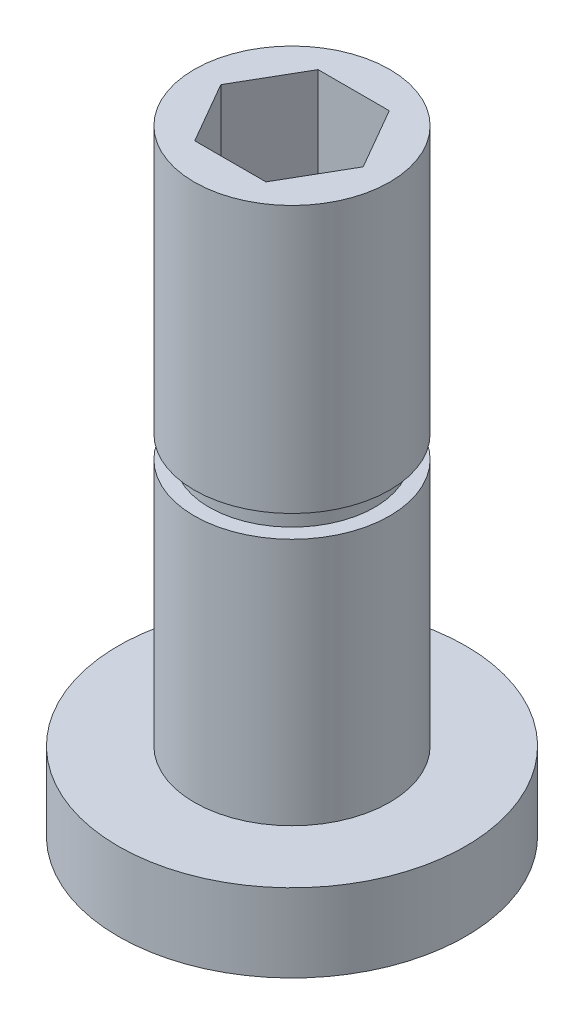
ISO-10303-21;
HEADER;
FILE_DESCRIPTION(('STEP AP214'),'2;1');
FILE_NAME('part.step','',(''),(''),'','','');
FILE_SCHEMA(('AUTOMOTIVE_DESIGN { 1 0 10303 214 1 1 1 1 }'));
ENDSEC;
DATA;
#1=APPLICATION_CONTEXT('core data for automotive mechanical design processes');
#2=APPLICATION_PROTOCOL_DEFINITION('international standard','automotive_design',2000,#1);
#3=PRODUCT_CONTEXT('',#1,'mechanical');
#4=PRODUCT('Part','Part','',(#3));
#5=PRODUCT_RELATED_PRODUCT_CATEGORY('part','',(#4));
#6=PRODUCT_DEFINITION_FORMATION('','',#4);
#7=PRODUCT_DEFINITION_CONTEXT('part definition',#1,'design');
#8=PRODUCT_DEFINITION('design','',#6,#7);
#9=PRODUCT_DEFINITION_SHAPE('','',#8);
#10=(LENGTH_UNIT() NAMED_UNIT(*) SI_UNIT(.MILLI.,.METRE.));
#11=(NAMED_UNIT(*) PLANE_ANGLE_UNIT() SI_UNIT($,.RADIAN.));
#12=(NAMED_UNIT(*) SI_UNIT($,.STERADIAN.) SOLID_ANGLE_UNIT());
#13=UNCERTAINTY_MEASURE_WITH_UNIT(LENGTH_MEASURE(1.E-05),#10,'distance_accuracy_value','');
#14=(GEOMETRIC_REPRESENTATION_CONTEXT(3) GLOBAL_UNCERTAINTY_ASSIGNED_CONTEXT((#13)) GLOBAL_UNIT_ASSIGNED_CONTEXT((#10,
#11,#12)) REPRESENTATION_CONTEXT('',''));
#15=CARTESIAN_POINT('',(0.,0.,0.));
#16=DIRECTION('',(0.,0.,1.));
#17=DIRECTION('',(1.,0.,0.));
#18=AXIS2_PLACEMENT_3D('',#15,#16,#17);
#19=CARTESIAN_POINT('',(0.,31.5,0.));
#20=DIRECTION('',(0.,-1.,0.));
#21=DIRECTION('',(0.,0.,-1.));
#22=AXIS2_PLACEMENT_3D('',#19,#20,#21);
#23=CYLINDRICAL_SURFACE('',#22,5.);
#24=CARTESIAN_POINT('',(0.,4.,0.));
#25=DIRECTION('',(0.,1.,0.));
#26=DIRECTION('',(0.,0.,1.));
#27=AXIS2_PLACEMENT_3D('',#24,#25,#26);
#28=CIRCLE('',#27,5.);
#29=CARTESIAN_POINT('',(0.,4.,5.));
#30=VERTEX_POINT('',#29);
#31=EDGE_CURVE('E165',#30,#30,#28,.T.);
#32=ORIENTED_EDGE('',*,*,#31,.T.);
#33=EDGE_LOOP('',(#32));
#34=FACE_BOUND('',#33,.T.);
#35=CARTESIAN_POINT('',(0.,16.7,0.));
#36=DIRECTION('',(0.,1.,0.));
#37=DIRECTION('',(0.,0.,1.));
#38=AXIS2_PLACEMENT_3D('',#35,#36,#37);
#39=CIRCLE('',#38,5.);
#40=CARTESIAN_POINT('',(0.,16.7,5.));
#41=VERTEX_POINT('',#40);
#42=EDGE_CURVE('E159',#41,#41,#39,.T.);
#43=ORIENTED_EDGE('',*,*,#42,.F.);
#44=EDGE_LOOP('',(#43));
#45=FACE_BOUND('',#44,.T.);
#46=ADVANCED_FACE('F48',(#34,#45),#23,.T.);
#47=CARTESIAN_POINT('',(0.,4.,0.));
#48=DIRECTION('',(0.,-1.,0.));
#49=DIRECTION('',(0.,0.,-1.));
#50=AXIS2_PLACEMENT_3D('',#47,#48,#49);
#51=CYLINDRICAL_SURFACE('',#50,8.89);
#52=CARTESIAN_POINT('',(0.,4.,0.));
#53=DIRECTION('',(0.,1.,0.));
#54=DIRECTION('',(0.,0.,1.));
#55=AXIS2_PLACEMENT_3D('',#52,#53,#54);
#56=CIRCLE('',#55,8.89);
#57=CARTESIAN_POINT('',(0.,4.,8.89));
#58=VERTEX_POINT('',#57);
#59=EDGE_CURVE('E13',#58,#58,#56,.T.);
#60=ORIENTED_EDGE('',*,*,#59,.F.);
#61=EDGE_LOOP('',(#60));
#62=FACE_BOUND('',#61,.T.);
#63=CARTESIAN_POINT('',(0.,0.,0.));
#64=DIRECTION('',(0.,1.,0.));
#65=DIRECTION('',(0.,0.,1.));
#66=AXIS2_PLACEMENT_3D('',#63,#64,#65);
#67=CIRCLE('',#66,8.89);
#68=CARTESIAN_POINT('',(0.,0.,8.89));
#69=VERTEX_POINT('',#68);
#70=EDGE_CURVE('E52',#69,#69,#67,.T.);
#71=ORIENTED_EDGE('',*,*,#70,.T.);
#72=EDGE_LOOP('',(#71));
#73=FACE_BOUND('',#72,.T.);
#74=ADVANCED_FACE('F50',(#62,#73),#51,.T.);
#75=CARTESIAN_POINT('',(0.,4.,0.));
#76=DIRECTION('',(0.,1.,0.));
#77=DIRECTION('',(0.,0.,1.));
#78=AXIS2_PLACEMENT_3D('',#75,#76,#77);
#79=PLANE('',#78);
#80=ORIENTED_EDGE('',*,*,#31,.F.);
#81=EDGE_LOOP('',(#80));
#82=FACE_BOUND('',#81,.T.);
#83=ORIENTED_EDGE('',*,*,#59,.T.);
#84=EDGE_LOOP('',(#83));
#85=FACE_BOUND('',#84,.T.);
#86=ADVANCED_FACE('F176',(#82,#85),#79,.T.);
#87=CARTESIAN_POINT('',(0.,0.,0.));
#88=DIRECTION('',(0.,1.,0.));
#89=DIRECTION('',(0.,0.,1.));
#90=AXIS2_PLACEMENT_3D('',#87,#88,#89);
#91=PLANE('',#90);
#92=ORIENTED_EDGE('',*,*,#70,.F.);
#93=EDGE_LOOP('',(#92));
#94=FACE_BOUND('',#93,.T.);
#95=ADVANCED_FACE('F179',(#94),#91,.F.);
#96=CARTESIAN_POINT('',(0.,17.843,0.));
#97=DIRECTION('',(0.,1.,0.));
#98=DIRECTION('',(0.,0.,1.));
#99=AXIS2_PLACEMENT_3D('',#96,#97,#98);
#100=PLANE('',#99);
#101=CARTESIAN_POINT('',(0.,17.843,0.));
#102=DIRECTION('',(0.,1.,0.));
#103=DIRECTION('',(0.,0.,1.));
#104=AXIS2_PLACEMENT_3D('',#101,#102,#103);
#105=CIRCLE('',#104,5.);
#106=CARTESIAN_POINT('',(0.,17.843,5.));
#107=VERTEX_POINT('',#106);
#108=EDGE_CURVE('E162',#107,#107,#105,.T.);
#109=ORIENTED_EDGE('',*,*,#108,.F.);
#110=EDGE_LOOP('',(#109));
#111=FACE_BOUND('',#110,.T.);
#112=CARTESIAN_POINT('',(0.,17.843,0.));
#113=DIRECTION('',(0.,1.,0.));
#114=DIRECTION('',(0.,0.,1.));
#115=AXIS2_PLACEMENT_3D('',#112,#113,#114);
#116=CIRCLE('',#115,4.238);
#117=CARTESIAN_POINT('',(0.,17.843,4.238));
#118=VERTEX_POINT('',#117);
#119=EDGE_CURVE('E156',#118,#118,#116,.T.);
#120=ORIENTED_EDGE('',*,*,#119,.T.);
#121=EDGE_LOOP('',(#120));
#122=FACE_BOUND('',#121,.T.);
#123=ADVANCED_FACE('F189',(#111,#122),#100,.F.);
#124=CARTESIAN_POINT('',(0.,16.7,0.));
#125=DIRECTION('',(0.,1.,0.));
#126=DIRECTION('',(0.,0.,1.));
#127=AXIS2_PLACEMENT_3D('',#124,#125,#126);
#128=PLANE('',#127);
#129=ORIENTED_EDGE('',*,*,#42,.T.);
#130=EDGE_LOOP('',(#129));
#131=FACE_BOUND('',#130,.T.);
#132=CARTESIAN_POINT('',(0.,16.7,0.));
#133=DIRECTION('',(0.,1.,0.));
#134=DIRECTION('',(0.,0.,1.));
#135=AXIS2_PLACEMENT_3D('',#132,#133,#134);
#136=CIRCLE('',#135,4.238);
#137=CARTESIAN_POINT('',(0.,16.7,4.238));
#138=VERTEX_POINT('',#137);
#139=EDGE_CURVE('E150',#138,#138,#136,.T.);
#140=ORIENTED_EDGE('',*,*,#139,.F.);
#141=EDGE_LOOP('',(#140));
#142=FACE_BOUND('',#141,.T.);
#143=ADVANCED_FACE('F193',(#131,#142),#128,.T.);
#144=CARTESIAN_POINT('',(0.,17.843,0.));
#145=DIRECTION('',(0.,-1.,0.));
#146=DIRECTION('',(0.,0.,-1.));
#147=AXIS2_PLACEMENT_3D('',#144,#145,#146);
#148=CYLINDRICAL_SURFACE('',#147,4.238);
#149=ORIENTED_EDGE('',*,*,#119,.F.);
#150=EDGE_LOOP('',(#149));
#151=FACE_BOUND('',#150,.T.);
#152=ORIENTED_EDGE('',*,*,#139,.T.);
#153=EDGE_LOOP('',(#152));
#154=FACE_BOUND('',#153,.T.);
#155=ADVANCED_FACE('F212',(#151,#154),#148,.T.);
#156=CARTESIAN_POINT('',(0.,31.5,0.));
#157=DIRECTION('',(0.,1.,0.));
#158=DIRECTION('',(0.,0.,1.));
#159=AXIS2_PLACEMENT_3D('',#156,#157,#158);
#160=PLANE('',#159);
#161=DIRECTION('',(0.5,0.,-0.866025403784438));
#162=VECTOR('',#161,1.);
#163=CARTESIAN_POINT('',(1.82244999999995,31.5,3.15657599425392));
#164=LINE('',#163,#162);
#165=CARTESIAN_POINT('',(1.82244999999995,31.5,3.15657599425392));
#166=VERTEX_POINT('',#165);
#167=CARTESIAN_POINT('',(3.64490000000001,31.5,0.));
#168=VERTEX_POINT('',#167);
#169=EDGE_CURVE('E63',#166,#168,#164,.T.);
#170=ORIENTED_EDGE('',*,*,#169,.F.);
#171=DIRECTION('',(1.,0.,0.));
#172=VECTOR('',#171,1.);
#173=CARTESIAN_POINT('',(-1.82245000000003,31.5,3.15657599425387));
#174=LINE('',#173,#172);
#175=CARTESIAN_POINT('',(-1.82245000000003,31.5,3.15657599425387));
#176=VERTEX_POINT('',#175);
#177=EDGE_CURVE('E146',#176,#166,#174,.T.);
#178=ORIENTED_EDGE('',*,*,#177,.F.);
#179=DIRECTION('',(0.499999999999999,0.,0.866025403784438));
#180=VECTOR('',#179,1.);
#181=CARTESIAN_POINT('',(-3.64490000000009,31.5,-1.11022302462516E-13));
#182=LINE('',#181,#180);
#183=CARTESIAN_POINT('',(-3.64490000000009,31.5,-1.11022302462516E-13));
#184=VERTEX_POINT('',#183);
#185=EDGE_CURVE('E144',#184,#176,#182,.T.);
#186=ORIENTED_EDGE('',*,*,#185,.F.);
#187=DIRECTION('',(-0.5,0.,0.866025403784438));
#188=VECTOR('',#187,1.);
#189=CARTESIAN_POINT('',(-1.82245,31.5,-3.1565759942539));
#190=LINE('',#189,#188);
#191=CARTESIAN_POINT('',(-1.82245,31.5,-3.1565759942539));
#192=VERTEX_POINT('',#191);
#193=EDGE_CURVE('E111',#192,#184,#190,.T.);
#194=ORIENTED_EDGE('',*,*,#193,.F.);
#195=DIRECTION('',(-1.,0.,0.));
#196=VECTOR('',#195,1.);
#197=CARTESIAN_POINT('',(1.82244999999998,31.5,-3.1565759942539));
#198=LINE('',#197,#196);
#199=CARTESIAN_POINT('',(1.82244999999998,31.5,-3.1565759942539));
#200=VERTEX_POINT('',#199);
#201=EDGE_CURVE('E140',#200,#192,#198,.T.);
#202=ORIENTED_EDGE('',*,*,#201,.F.);
#203=DIRECTION('',(-0.499999999999999,0.,-0.866025403784438));
#204=VECTOR('',#203,1.);
#205=CARTESIAN_POINT('',(3.64490000000001,31.5,0.));
#206=LINE('',#205,#204);
#207=EDGE_CURVE('E137',#168,#200,#206,.T.);
#208=ORIENTED_EDGE('',*,*,#207,.F.);
#209=EDGE_LOOP('',(#170,#178,#186,#194,#202,#208));
#210=FACE_BOUND('',#209,.T.);
#211=CARTESIAN_POINT('',(0.,31.5,0.));
#212=DIRECTION('',(0.,1.,0.));
#213=DIRECTION('',(0.,0.,1.));
#214=AXIS2_PLACEMENT_3D('',#211,#212,#213);
#215=CIRCLE('',#214,5.);
#216=CARTESIAN_POINT('',(0.,31.5,5.));
#217=VERTEX_POINT('',#216);
#218=EDGE_CURVE('E168',#217,#217,#215,.T.);
#219=ORIENTED_EDGE('',*,*,#218,.T.);
#220=EDGE_LOOP('',(#219));
#221=FACE_BOUND('',#220,.T.);
#222=ADVANCED_FACE('F204',(#210,#221),#160,.T.);
#223=ORIENTED_EDGE('',*,*,#108,.T.);
#224=EDGE_LOOP('',(#223));
#225=FACE_BOUND('',#224,.T.);
#226=ORIENTED_EDGE('',*,*,#218,.F.);
#227=EDGE_LOOP('',(#226));
#228=FACE_BOUND('',#227,.T.);
#229=ADVANCED_FACE('F198',(#225,#228),#23,.T.);
#230=CARTESIAN_POINT('',(1.82244999999995,20.451,3.15657599425392));
#231=DIRECTION('',(0.866025403784438,0.,0.5));
#232=DIRECTION('',(0.5,0.,-0.866025403784438));
#233=AXIS2_PLACEMENT_3D('',#230,#231,#232);
#234=PLANE('',#233);
#235=ORIENTED_EDGE('',*,*,#169,.T.);
#236=DIRECTION('',(0.,1.,0.));
#237=VECTOR('',#236,1.);
#238=CARTESIAN_POINT('',(3.64490000000001,20.451,0.));
#239=LINE('',#238,#237);
#240=CARTESIAN_POINT('',(3.64490000000001,20.451,0.));
#241=VERTEX_POINT('',#240);
#242=EDGE_CURVE('E93',#241,#168,#239,.T.);
#243=ORIENTED_EDGE('',*,*,#242,.F.);
#244=DIRECTION('',(0.5,0.,-0.866025403784438));
#245=VECTOR('',#244,1.);
#246=CARTESIAN_POINT('',(1.82244999999995,20.451,3.15657599425392));
#247=LINE('',#246,#245);
#248=CARTESIAN_POINT('',(1.82244999999995,20.451,3.15657599425392));
#249=VERTEX_POINT('',#248);
#250=EDGE_CURVE('E148',#249,#241,#247,.T.);
#251=ORIENTED_EDGE('',*,*,#250,.F.);
#252=DIRECTION('',(0.,1.,0.));
#253=VECTOR('',#252,1.);
#254=CARTESIAN_POINT('',(1.82244999999995,20.451,3.15657599425392));
#255=LINE('',#254,#253);
#256=EDGE_CURVE('E71',#249,#166,#255,.T.);
#257=ORIENTED_EDGE('',*,*,#256,.T.);
#258=EDGE_LOOP('',(#235,#243,#251,#257));
#259=FACE_BOUND('',#258,.T.);
#260=ADVANCED_FACE('F203',(#259),#234,.F.);
#261=CARTESIAN_POINT('',(-1.82245000000003,20.451,3.15657599425387));
#262=DIRECTION('',(0.,0.,1.));
#263=DIRECTION('',(1.,0.,0.));
#264=AXIS2_PLACEMENT_3D('',#261,#262,#263);
#265=PLANE('',#264);
#266=ORIENTED_EDGE('',*,*,#177,.T.);
#267=ORIENTED_EDGE('',*,*,#256,.F.);
#268=DIRECTION('',(1.,0.,0.));
#269=VECTOR('',#268,1.);
#270=CARTESIAN_POINT('',(-1.82245000000003,20.451,3.15657599425387));
#271=LINE('',#270,#269);
#272=CARTESIAN_POINT('',(-1.82245000000003,20.451,3.15657599425387));
#273=VERTEX_POINT('',#272);
#274=EDGE_CURVE('E123',#273,#249,#271,.T.);
#275=ORIENTED_EDGE('',*,*,#274,.F.);
#276=DIRECTION('',(0.,1.,0.));
#277=VECTOR('',#276,1.);
#278=CARTESIAN_POINT('',(-1.82245000000003,20.451,3.15657599425387));
#279=LINE('',#278,#277);
#280=EDGE_CURVE('E115',#273,#176,#279,.T.);
#281=ORIENTED_EDGE('',*,*,#280,.T.);
#282=EDGE_LOOP('',(#266,#267,#275,#281));
#283=FACE_BOUND('',#282,.T.);
#284=ADVANCED_FACE('F210',(#283),#265,.F.);
#285=CARTESIAN_POINT('',(-3.64490000000009,20.451,-1.11022302462516E-13));
#286=DIRECTION('',(-0.866025403784438,0.,0.499999999999999));
#287=DIRECTION('',(0.499999999999999,0.,0.866025403784438));
#288=AXIS2_PLACEMENT_3D('',#285,#286,#287);
#289=PLANE('',#288);
#290=ORIENTED_EDGE('',*,*,#185,.T.);
#291=ORIENTED_EDGE('',*,*,#280,.F.);
#292=DIRECTION('',(0.499999999999999,0.,0.866025403784438));
#293=VECTOR('',#292,1.);
#294=CARTESIAN_POINT('',(-3.64490000000009,20.451,-1.11022302462516E-13));
#295=LINE('',#294,#293);
#296=CARTESIAN_POINT('',(-3.64490000000009,20.451,-1.11022302462516E-13));
#297=VERTEX_POINT('',#296);
#298=EDGE_CURVE('E119',#297,#273,#295,.T.);
#299=ORIENTED_EDGE('',*,*,#298,.F.);
#300=DIRECTION('',(0.,1.,0.));
#301=VECTOR('',#300,1.);
#302=CARTESIAN_POINT('',(-3.64490000000009,20.451,-1.11022302462516E-13));
#303=LINE('',#302,#301);
#304=EDGE_CURVE('E104',#297,#184,#303,.T.);
#305=ORIENTED_EDGE('',*,*,#304,.T.);
#306=EDGE_LOOP('',(#290,#291,#299,#305));
#307=FACE_BOUND('',#306,.T.);
#308=ADVANCED_FACE('F120',(#307),#289,.F.);
#309=CARTESIAN_POINT('',(-1.82245,20.451,-3.1565759942539));
#310=DIRECTION('',(-0.866025403784438,0.,-0.5));
#311=DIRECTION('',(-0.5,0.,0.866025403784438));
#312=AXIS2_PLACEMENT_3D('',#309,#310,#311);
#313=PLANE('',#312);
#314=ORIENTED_EDGE('',*,*,#193,.T.);
#315=ORIENTED_EDGE('',*,*,#304,.F.);
#316=DIRECTION('',(-0.5,0.,0.866025403784438));
#317=VECTOR('',#316,1.);
#318=CARTESIAN_POINT('',(-1.82245,20.451,-3.1565759942539));
#319=LINE('',#318,#317);
#320=CARTESIAN_POINT('',(-1.82245,20.451,-3.1565759942539));
#321=VERTEX_POINT('',#320);
#322=EDGE_CURVE('E108',#321,#297,#319,.T.);
#323=ORIENTED_EDGE('',*,*,#322,.F.);
#324=DIRECTION('',(0.,1.,0.));
#325=VECTOR('',#324,1.);
#326=CARTESIAN_POINT('',(-1.82245,20.451,-3.1565759942539));
#327=LINE('',#326,#325);
#328=EDGE_CURVE('E116',#321,#192,#327,.T.);
#329=ORIENTED_EDGE('',*,*,#328,.T.);
#330=EDGE_LOOP('',(#314,#315,#323,#329));
#331=FACE_BOUND('',#330,.T.);
#332=ADVANCED_FACE('F106',(#331),#313,.F.);
#333=CARTESIAN_POINT('',(1.82244999999998,20.451,-3.1565759942539));
#334=DIRECTION('',(0.,0.,-1.));
#335=DIRECTION('',(-1.,0.,0.));
#336=AXIS2_PLACEMENT_3D('',#333,#334,#335);
#337=PLANE('',#336);
#338=ORIENTED_EDGE('',*,*,#201,.T.);
#339=ORIENTED_EDGE('',*,*,#328,.F.);
#340=DIRECTION('',(-1.,0.,0.));
#341=VECTOR('',#340,1.);
#342=CARTESIAN_POINT('',(1.82244999999998,20.451,-3.1565759942539));
#343=LINE('',#342,#341);
#344=CARTESIAN_POINT('',(1.82244999999998,20.451,-3.1565759942539));
#345=VERTEX_POINT('',#344);
#346=EDGE_CURVE('E129',#345,#321,#343,.T.);
#347=ORIENTED_EDGE('',*,*,#346,.F.);
#348=DIRECTION('',(0.,1.,0.));
#349=VECTOR('',#348,1.);
#350=CARTESIAN_POINT('',(1.82244999999998,20.451,-3.1565759942539));
#351=LINE('',#350,#349);
#352=EDGE_CURVE('E153',#345,#200,#351,.T.);
#353=ORIENTED_EDGE('',*,*,#352,.T.);
#354=EDGE_LOOP('',(#338,#339,#347,#353));
#355=FACE_BOUND('',#354,.T.);
#356=ADVANCED_FACE('F235',(#355),#337,.F.);
#357=CARTESIAN_POINT('',(3.64490000000001,20.451,0.));
#358=DIRECTION('',(0.866025403784438,0.,-0.499999999999999));
#359=DIRECTION('',(-0.499999999999999,0.,-0.866025403784438));
#360=AXIS2_PLACEMENT_3D('',#357,#358,#359);
#361=PLANE('',#360);
#362=ORIENTED_EDGE('',*,*,#207,.T.);
#363=ORIENTED_EDGE('',*,*,#352,.F.);
#364=DIRECTION('',(-0.499999999999999,0.,-0.866025403784438));
#365=VECTOR('',#364,1.);
#366=CARTESIAN_POINT('',(3.64490000000001,20.451,0.));
#367=LINE('',#366,#365);
#368=EDGE_CURVE('E131',#241,#345,#367,.T.);
#369=ORIENTED_EDGE('',*,*,#368,.F.);
#370=ORIENTED_EDGE('',*,*,#242,.T.);
#371=EDGE_LOOP('',(#362,#363,#369,#370));
#372=FACE_BOUND('',#371,.T.);
#373=ADVANCED_FACE('F232',(#372),#361,.F.);
#374=CARTESIAN_POINT('',(0.,20.451,0.));
#375=DIRECTION('',(0.,1.,0.));
#376=DIRECTION('',(0.,0.,1.));
#377=AXIS2_PLACEMENT_3D('',#374,#375,#376);
#378=PLANE('',#377);
#379=ORIENTED_EDGE('',*,*,#250,.T.);
#380=ORIENTED_EDGE('',*,*,#368,.T.);
#381=ORIENTED_EDGE('',*,*,#346,.T.);
#382=ORIENTED_EDGE('',*,*,#322,.T.);
#383=ORIENTED_EDGE('',*,*,#298,.T.);
#384=ORIENTED_EDGE('',*,*,#274,.T.);
#385=EDGE_LOOP('',(#379,#380,#381,#382,#383,#384));
#386=FACE_BOUND('',#385,.T.);
#387=ADVANCED_FACE('F126',(#386),#378,.T.);
#388=CLOSED_SHELL('',(#46,#74,#86,#95,#123,#143,#155,#222,#229,#260,#284,#308,#332,#356,#373,#387));
#389=MANIFOLD_SOLID_BREP('B2',#388);
#390=ADVANCED_BREP_SHAPE_REPRESENTATION('',(#18,#389),#14);
#391=SHAPE_DEFINITION_REPRESENTATION(#9,#390);
ENDSEC;
END-ISO-10303-21;
